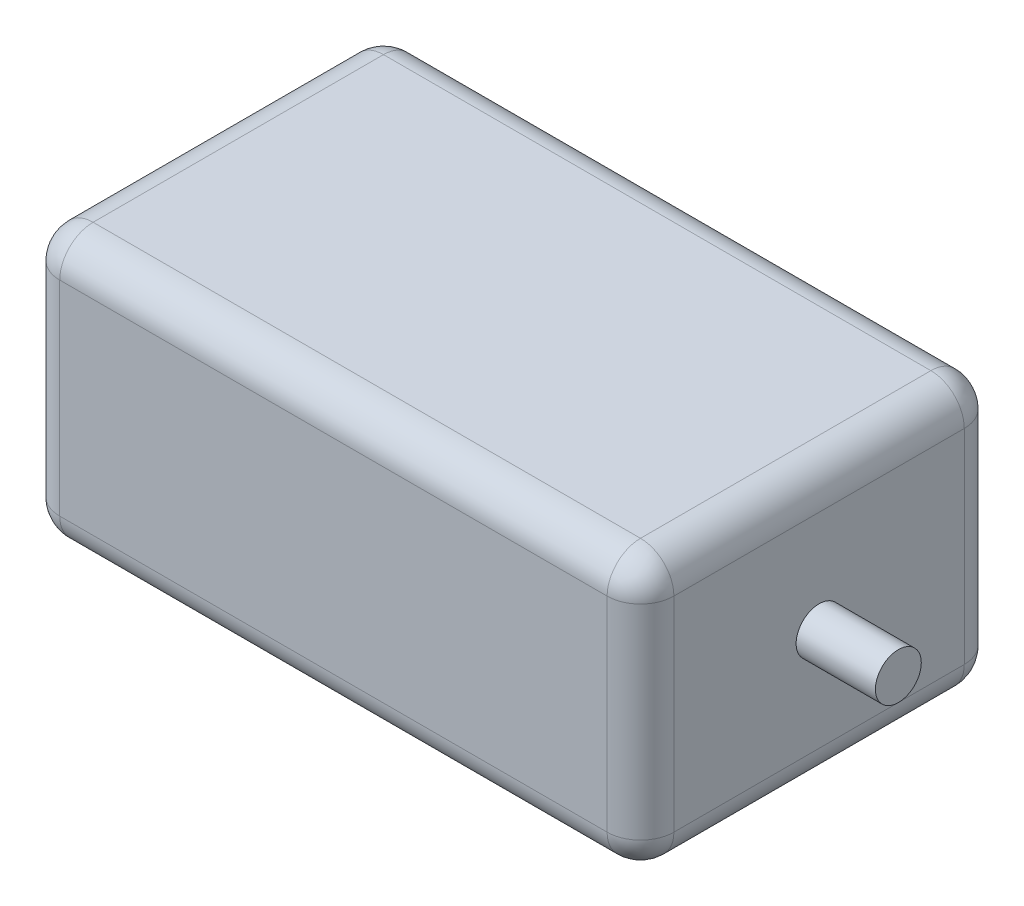
ISO-10303-21;
HEADER;
FILE_DESCRIPTION(('STEP AP214'),'2;1');
FILE_NAME('part.step','',(''),(''),'','','');
FILE_SCHEMA(('AUTOMOTIVE_DESIGN { 1 0 10303 214 1 1 1 1 }'));
ENDSEC;
DATA;
#1=APPLICATION_CONTEXT('core data for automotive mechanical design processes');
#2=APPLICATION_PROTOCOL_DEFINITION('international standard','automotive_design',2000,#1);
#3=PRODUCT_CONTEXT('',#1,'mechanical');
#4=PRODUCT('Part','Part','',(#3));
#5=PRODUCT_RELATED_PRODUCT_CATEGORY('part','',(#4));
#6=PRODUCT_DEFINITION_FORMATION('','',#4);
#7=PRODUCT_DEFINITION_CONTEXT('part definition',#1,'design');
#8=PRODUCT_DEFINITION('design','',#6,#7);
#9=PRODUCT_DEFINITION_SHAPE('','',#8);
#10=(LENGTH_UNIT() NAMED_UNIT(*) SI_UNIT(.MILLI.,.METRE.));
#11=(NAMED_UNIT(*) PLANE_ANGLE_UNIT() SI_UNIT($,.RADIAN.));
#12=(NAMED_UNIT(*) SI_UNIT($,.STERADIAN.) SOLID_ANGLE_UNIT());
#13=UNCERTAINTY_MEASURE_WITH_UNIT(LENGTH_MEASURE(1.E-05),#10,'distance_accuracy_value','');
#14=(GEOMETRIC_REPRESENTATION_CONTEXT(3) GLOBAL_UNCERTAINTY_ASSIGNED_CONTEXT((#13)) GLOBAL_UNIT_ASSIGNED_CONTEXT((#10,
#11,#12)) REPRESENTATION_CONTEXT('',''));
#15=CARTESIAN_POINT('',(0.,0.,0.));
#16=DIRECTION('',(0.,0.,1.));
#17=DIRECTION('',(1.,0.,0.));
#18=AXIS2_PLACEMENT_3D('',#15,#16,#17);
#19=CARTESIAN_POINT('',(40.0587135775645,32.5,-21.4));
#20=DIRECTION('',(-1.,0.,0.));
#21=DIRECTION('',(0.,0.,1.));
#22=AXIS2_PLACEMENT_3D('',#19,#20,#21);
#23=PLANE('',#22);
#24=DIRECTION('',(0.,0.,-1.));
#25=VECTOR('',#24,1.);
#26=CARTESIAN_POINT('',(40.0587135775645,28.5,21.4));
#27=LINE('',#26,#25);
#28=CARTESIAN_POINT('',(40.0587135775645,28.5,-17.4));
#29=VERTEX_POINT('',#28);
#30=CARTESIAN_POINT('',(40.0587135775645,28.5,17.4));
#31=VERTEX_POINT('',#30);
#32=EDGE_CURVE('E164',#29,#31,#27,.F.);
#33=ORIENTED_EDGE('',*,*,#32,.T.);
#34=DIRECTION('',(0.,-1.,0.));
#35=VECTOR('',#34,1.);
#36=CARTESIAN_POINT('',(40.0587135775645,32.5,17.4));
#37=LINE('',#36,#35);
#38=CARTESIAN_POINT('',(40.0587135775645,4.,17.4));
#39=VERTEX_POINT('',#38);
#40=EDGE_CURVE('E132',#31,#39,#37,.T.);
#41=ORIENTED_EDGE('',*,*,#40,.T.);
#42=DIRECTION('',(0.,0.,-1.));
#43=VECTOR('',#42,1.);
#44=CARTESIAN_POINT('',(40.0587135775645,4.,-21.4));
#45=LINE('',#44,#43);
#46=CARTESIAN_POINT('',(40.0587135775645,4.,-17.4));
#47=VERTEX_POINT('',#46);
#48=EDGE_CURVE('E152',#39,#47,#45,.T.);
#49=ORIENTED_EDGE('',*,*,#48,.T.);
#50=DIRECTION('',(0.,-1.,0.));
#51=VECTOR('',#50,1.);
#52=CARTESIAN_POINT('',(40.0587135775645,32.5,-17.4));
#53=LINE('',#52,#51);
#54=EDGE_CURVE('E159',#47,#29,#53,.F.);
#55=ORIENTED_EDGE('',*,*,#54,.T.);
#56=EDGE_LOOP('',(#33,#41,#49,#55));
#57=FACE_BOUND('',#56,.T.);
#58=CARTESIAN_POINT('',(40.0587135775645,16.25,0.));
#59=DIRECTION('',(-1.,0.,0.));
#60=DIRECTION('',(0.,0.,1.));
#61=AXIS2_PLACEMENT_3D('',#58,#59,#60);
#62=CIRCLE('',#61,2.75);
#63=CARTESIAN_POINT('',(40.0587135775645,16.25,2.75));
#64=VERTEX_POINT('',#63);
#65=EDGE_CURVE('E160',#64,#64,#62,.F.);
#66=ORIENTED_EDGE('',*,*,#65,.F.);
#67=EDGE_LOOP('',(#66));
#68=FACE_BOUND('',#67,.T.);
#69=ADVANCED_FACE('F38',(#57,#68),#23,.F.);
#70=CARTESIAN_POINT('',(-33.5412864224355,32.5,-21.4));
#71=DIRECTION('',(0.,0.,1.));
#72=DIRECTION('',(1.,0.,0.));
#73=AXIS2_PLACEMENT_3D('',#70,#71,#72);
#74=PLANE('',#73);
#75=DIRECTION('',(-1.,0.,0.));
#76=VECTOR('',#75,1.);
#77=CARTESIAN_POINT('',(40.0587135775645,28.5,-21.4));
#78=LINE('',#77,#76);
#79=CARTESIAN_POINT('',(-29.5412864224355,28.5,-21.4));
#80=VERTEX_POINT('',#79);
#81=CARTESIAN_POINT('',(36.0587135775645,28.5,-21.4));
#82=VERTEX_POINT('',#81);
#83=EDGE_CURVE('E202',#80,#82,#78,.F.);
#84=ORIENTED_EDGE('',*,*,#83,.T.);
#85=DIRECTION('',(0.,-1.,0.));
#86=VECTOR('',#85,1.);
#87=CARTESIAN_POINT('',(36.0587135775645,32.5,-21.4));
#88=LINE('',#87,#86);
#89=CARTESIAN_POINT('',(36.0587135775645,4.,-21.4));
#90=VERTEX_POINT('',#89);
#91=EDGE_CURVE('E205',#82,#90,#88,.T.);
#92=ORIENTED_EDGE('',*,*,#91,.T.);
#93=DIRECTION('',(-1.,0.,0.));
#94=VECTOR('',#93,1.);
#95=CARTESIAN_POINT('',(-33.5412864224355,4.,-21.4));
#96=LINE('',#95,#94);
#97=CARTESIAN_POINT('',(-29.5412864224355,4.,-21.4));
#98=VERTEX_POINT('',#97);
#99=EDGE_CURVE('E199',#90,#98,#96,.T.);
#100=ORIENTED_EDGE('',*,*,#99,.T.);
#101=DIRECTION('',(0.,-1.,0.));
#102=VECTOR('',#101,1.);
#103=CARTESIAN_POINT('',(-29.5412864224355,32.5,-21.4));
#104=LINE('',#103,#102);
#105=EDGE_CURVE('E196',#98,#80,#104,.F.);
#106=ORIENTED_EDGE('',*,*,#105,.T.);
#107=EDGE_LOOP('',(#84,#92,#100,#106));
#108=FACE_BOUND('',#107,.T.);
#109=ADVANCED_FACE('F374',(#108),#74,.F.);
#110=CARTESIAN_POINT('',(-33.5412864224355,32.5,-21.4));
#111=DIRECTION('',(1.,0.,0.));
#112=DIRECTION('',(0.,0.,-1.));
#113=AXIS2_PLACEMENT_3D('',#110,#111,#112);
#114=PLANE('',#113);
#115=DIRECTION('',(0.,0.,1.));
#116=VECTOR('',#115,1.);
#117=CARTESIAN_POINT('',(-33.5412864224355,4.,-21.4));
#118=LINE('',#117,#116);
#119=CARTESIAN_POINT('',(-33.5412864224355,4.,-17.4));
#120=VERTEX_POINT('',#119);
#121=CARTESIAN_POINT('',(-33.5412864224355,4.,17.4));
#122=VERTEX_POINT('',#121);
#123=EDGE_CURVE('E59',#120,#122,#118,.T.);
#124=ORIENTED_EDGE('',*,*,#123,.T.);
#125=DIRECTION('',(0.,-1.,0.));
#126=VECTOR('',#125,1.);
#127=CARTESIAN_POINT('',(-33.5412864224355,32.5,17.4));
#128=LINE('',#127,#126);
#129=CARTESIAN_POINT('',(-33.5412864224355,28.5,17.4));
#130=VERTEX_POINT('',#129);
#131=EDGE_CURVE('E11',#122,#130,#128,.F.);
#132=ORIENTED_EDGE('',*,*,#131,.T.);
#133=DIRECTION('',(0.,0.,1.));
#134=VECTOR('',#133,1.);
#135=CARTESIAN_POINT('',(-33.5412864224355,28.5,-21.4));
#136=LINE('',#135,#134);
#137=CARTESIAN_POINT('',(-33.5412864224355,28.5,-17.4));
#138=VERTEX_POINT('',#137);
#139=EDGE_CURVE('E48',#130,#138,#136,.F.);
#140=ORIENTED_EDGE('',*,*,#139,.T.);
#141=DIRECTION('',(0.,-1.,0.));
#142=VECTOR('',#141,1.);
#143=CARTESIAN_POINT('',(-33.5412864224355,32.5,-17.4));
#144=LINE('',#143,#142);
#145=EDGE_CURVE('E222',#138,#120,#144,.T.);
#146=ORIENTED_EDGE('',*,*,#145,.T.);
#147=EDGE_LOOP('',(#124,#132,#140,#146));
#148=FACE_BOUND('',#147,.T.);
#149=ADVANCED_FACE('F380',(#148),#114,.F.);
#150=CARTESIAN_POINT('',(-33.5412864224355,32.5,21.4));
#151=DIRECTION('',(0.,0.,-1.));
#152=DIRECTION('',(-1.,0.,0.));
#153=AXIS2_PLACEMENT_3D('',#150,#151,#152);
#154=PLANE('',#153);
#155=DIRECTION('',(1.,0.,0.));
#156=VECTOR('',#155,1.);
#157=CARTESIAN_POINT('',(-33.5412864224355,4.,21.4));
#158=LINE('',#157,#156);
#159=CARTESIAN_POINT('',(-29.5412864224355,4.,21.4));
#160=VERTEX_POINT('',#159);
#161=CARTESIAN_POINT('',(36.0587135775645,4.,21.4));
#162=VERTEX_POINT('',#161);
#163=EDGE_CURVE('E171',#160,#162,#158,.T.);
#164=ORIENTED_EDGE('',*,*,#163,.T.);
#165=DIRECTION('',(0.,-1.,0.));
#166=VECTOR('',#165,1.);
#167=CARTESIAN_POINT('',(36.0587135775645,32.5,21.4));
#168=LINE('',#167,#166);
#169=CARTESIAN_POINT('',(36.0587135775645,28.5,21.4));
#170=VERTEX_POINT('',#169);
#171=EDGE_CURVE('E134',#162,#170,#168,.F.);
#172=ORIENTED_EDGE('',*,*,#171,.T.);
#173=DIRECTION('',(1.,0.,0.));
#174=VECTOR('',#173,1.);
#175=CARTESIAN_POINT('',(-33.5412864224355,28.5,21.4));
#176=LINE('',#175,#174);
#177=CARTESIAN_POINT('',(-29.5412864224355,28.5,21.4));
#178=VERTEX_POINT('',#177);
#179=EDGE_CURVE('E178',#170,#178,#176,.F.);
#180=ORIENTED_EDGE('',*,*,#179,.T.);
#181=DIRECTION('',(0.,-1.,0.));
#182=VECTOR('',#181,1.);
#183=CARTESIAN_POINT('',(-29.5412864224355,32.5,21.4));
#184=LINE('',#183,#182);
#185=EDGE_CURVE('E167',#178,#160,#184,.T.);
#186=ORIENTED_EDGE('',*,*,#185,.T.);
#187=EDGE_LOOP('',(#164,#172,#180,#186));
#188=FACE_BOUND('',#187,.T.);
#189=ADVANCED_FACE('F346',(#188),#154,.F.);
#190=CARTESIAN_POINT('',(0.,32.5,0.));
#191=DIRECTION('',(0.,1.,0.));
#192=DIRECTION('',(0.,0.,1.));
#193=AXIS2_PLACEMENT_3D('',#190,#191,#192);
#194=PLANE('',#193);
#195=DIRECTION('',(1.,0.,0.));
#196=VECTOR('',#195,1.);
#197=CARTESIAN_POINT('',(40.0587135775645,32.5,17.4));
#198=LINE('',#197,#196);
#199=CARTESIAN_POINT('',(-29.5412864224355,32.5,17.4));
#200=VERTEX_POINT('',#199);
#201=CARTESIAN_POINT('',(36.0587135775645,32.5,17.4));
#202=VERTEX_POINT('',#201);
#203=EDGE_CURVE('E183',#200,#202,#198,.T.);
#204=ORIENTED_EDGE('',*,*,#203,.T.);
#205=DIRECTION('',(0.,0.,-1.));
#206=VECTOR('',#205,1.);
#207=CARTESIAN_POINT('',(36.0587135775645,32.5,-21.4));
#208=LINE('',#207,#206);
#209=CARTESIAN_POINT('',(36.0587135775645,32.5,-17.4));
#210=VERTEX_POINT('',#209);
#211=EDGE_CURVE('E192',#202,#210,#208,.T.);
#212=ORIENTED_EDGE('',*,*,#211,.T.);
#213=DIRECTION('',(-1.,0.,0.));
#214=VECTOR('',#213,1.);
#215=CARTESIAN_POINT('',(-33.5412864224355,32.5,-17.4));
#216=LINE('',#215,#214);
#217=CARTESIAN_POINT('',(-29.5412864224355,32.5,-17.4));
#218=VERTEX_POINT('',#217);
#219=EDGE_CURVE('E189',#210,#218,#216,.T.);
#220=ORIENTED_EDGE('',*,*,#219,.T.);
#221=DIRECTION('',(0.,0.,1.));
#222=VECTOR('',#221,1.);
#223=CARTESIAN_POINT('',(-29.5412864224355,32.5,21.4));
#224=LINE('',#223,#222);
#225=EDGE_CURVE('E186',#218,#200,#224,.T.);
#226=ORIENTED_EDGE('',*,*,#225,.T.);
#227=EDGE_LOOP('',(#204,#212,#220,#226));
#228=FACE_BOUND('',#227,.T.);
#229=ADVANCED_FACE('F557',(#228),#194,.T.);
#230=CARTESIAN_POINT('',(0.,0.,0.));
#231=DIRECTION('',(0.,1.,0.));
#232=DIRECTION('',(0.,0.,1.));
#233=AXIS2_PLACEMENT_3D('',#230,#231,#232);
#234=PLANE('',#233);
#235=DIRECTION('',(0.,0.,1.));
#236=VECTOR('',#235,1.);
#237=CARTESIAN_POINT('',(-29.5412864224355,0.,0.));
#238=LINE('',#237,#236);
#239=CARTESIAN_POINT('',(-29.5412864224355,0.,17.4));
#240=VERTEX_POINT('',#239);
#241=CARTESIAN_POINT('',(-29.5412864224355,0.,-17.4));
#242=VERTEX_POINT('',#241);
#243=EDGE_CURVE('E212',#240,#242,#238,.F.);
#244=ORIENTED_EDGE('',*,*,#243,.T.);
#245=DIRECTION('',(-1.,0.,0.));
#246=VECTOR('',#245,1.);
#247=CARTESIAN_POINT('',(0.,0.,-17.4));
#248=LINE('',#247,#246);
#249=CARTESIAN_POINT('',(36.0587135775645,0.,-17.4));
#250=VERTEX_POINT('',#249);
#251=EDGE_CURVE('E219',#242,#250,#248,.F.);
#252=ORIENTED_EDGE('',*,*,#251,.T.);
#253=DIRECTION('',(0.,0.,-1.));
#254=VECTOR('',#253,1.);
#255=CARTESIAN_POINT('',(36.0587135775645,0.,0.));
#256=LINE('',#255,#254);
#257=CARTESIAN_POINT('',(36.0587135775645,0.,17.4));
#258=VERTEX_POINT('',#257);
#259=EDGE_CURVE('E215',#250,#258,#256,.F.);
#260=ORIENTED_EDGE('',*,*,#259,.T.);
#261=DIRECTION('',(1.,0.,0.));
#262=VECTOR('',#261,1.);
#263=CARTESIAN_POINT('',(0.,0.,17.4));
#264=LINE('',#263,#262);
#265=EDGE_CURVE('E209',#258,#240,#264,.F.);
#266=ORIENTED_EDGE('',*,*,#265,.T.);
#267=EDGE_LOOP('',(#244,#252,#260,#266));
#268=FACE_BOUND('',#267,.T.);
#269=ADVANCED_FACE('F354',(#268),#234,.F.);
#270=CARTESIAN_POINT('',(49.5587135775645,16.25,0.));
#271=DIRECTION('',(-1.,0.,0.));
#272=DIRECTION('',(0.,0.,1.));
#273=AXIS2_PLACEMENT_3D('',#270,#271,#272);
#274=CYLINDRICAL_SURFACE('',#273,2.75);
#275=CARTESIAN_POINT('',(49.5587135775645,16.25,0.));
#276=DIRECTION('',(1.,0.,0.));
#277=DIRECTION('',(0.,0.,-1.));
#278=AXIS2_PLACEMENT_3D('',#275,#276,#277);
#279=CIRCLE('',#278,2.75);
#280=CARTESIAN_POINT('',(49.5587135775645,16.25,-2.75));
#281=VERTEX_POINT('',#280);
#282=EDGE_CURVE('E307',#281,#281,#279,.T.);
#283=ORIENTED_EDGE('',*,*,#282,.F.);
#284=EDGE_LOOP('',(#283));
#285=FACE_BOUND('',#284,.T.);
#286=ORIENTED_EDGE('',*,*,#65,.T.);
#287=EDGE_LOOP('',(#286));
#288=FACE_BOUND('',#287,.T.);
#289=ADVANCED_FACE('F542',(#285,#288),#274,.T.);
#290=CARTESIAN_POINT('',(49.5587135775645,16.25,0.));
#291=DIRECTION('',(1.,0.,0.));
#292=DIRECTION('',(0.,0.,-1.));
#293=AXIS2_PLACEMENT_3D('',#290,#291,#292);
#294=PLANE('',#293);
#295=ORIENTED_EDGE('',*,*,#282,.T.);
#296=EDGE_LOOP('',(#295));
#297=FACE_BOUND('',#296,.T.);
#298=ADVANCED_FACE('F534',(#297),#294,.T.);
#299=CARTESIAN_POINT('',(-29.5412864224355,32.5,-17.4));
#300=DIRECTION('',(0.,-1.,0.));
#301=DIRECTION('',(0.,0.,-1.));
#302=AXIS2_PLACEMENT_3D('',#299,#300,#301);
#303=CYLINDRICAL_SURFACE('',#302,4.);
#304=CARTESIAN_POINT('',(-29.5412864224355,28.5,-17.4));
#305=DIRECTION('',(0.,1.,0.));
#306=DIRECTION('',(0.,0.,1.));
#307=AXIS2_PLACEMENT_3D('',#304,#305,#306);
#308=CIRCLE('',#307,4.);
#309=EDGE_CURVE('E42',#80,#138,#308,.T.);
#310=ORIENTED_EDGE('',*,*,#309,.F.);
#311=ORIENTED_EDGE('',*,*,#105,.F.);
#312=CARTESIAN_POINT('',(-29.5412864224355,4.,-17.4));
#313=DIRECTION('',(0.,-1.,0.));
#314=DIRECTION('',(0.,0.,-1.));
#315=AXIS2_PLACEMENT_3D('',#312,#313,#314);
#316=CIRCLE('',#315,4.);
#317=EDGE_CURVE('E298',#120,#98,#316,.T.);
#318=ORIENTED_EDGE('',*,*,#317,.F.);
#319=ORIENTED_EDGE('',*,*,#145,.F.);
#320=EDGE_LOOP('',(#310,#311,#318,#319));
#321=FACE_BOUND('',#320,.T.);
#322=ADVANCED_FACE('F40',(#321),#303,.T.);
#323=CARTESIAN_POINT('',(-29.5412864224355,28.5,-17.4));
#324=DIRECTION('',(0.,0.,1.));
#325=DIRECTION('',(1.,0.,0.));
#326=AXIS2_PLACEMENT_3D('',#323,#324,#325);
#327=SPHERICAL_SURFACE('',#326,4.);
#328=CARTESIAN_POINT('',(-29.5412864224355,28.5,-17.4));
#329=DIRECTION('',(-1.,0.,0.));
#330=DIRECTION('',(0.,0.,1.));
#331=AXIS2_PLACEMENT_3D('',#328,#329,#330);
#332=CIRCLE('',#331,4.);
#333=EDGE_CURVE('E292',#80,#218,#332,.F.);
#334=ORIENTED_EDGE('',*,*,#333,.F.);
#335=ORIENTED_EDGE('',*,*,#309,.T.);
#336=CARTESIAN_POINT('',(-29.5412864224355,28.5,-17.4));
#337=DIRECTION('',(0.,0.,-1.));
#338=DIRECTION('',(-1.,0.,0.));
#339=AXIS2_PLACEMENT_3D('',#336,#337,#338);
#340=CIRCLE('',#339,4.);
#341=EDGE_CURVE('E296',#218,#138,#340,.F.);
#342=ORIENTED_EDGE('',*,*,#341,.F.);
#343=EDGE_LOOP('',(#334,#335,#342));
#344=FACE_BOUND('',#343,.T.);
#345=ADVANCED_FACE('F520',(#344),#327,.T.);
#346=CARTESIAN_POINT('',(-29.5412864224355,4.,-17.4));
#347=DIRECTION('',(0.,0.,1.));
#348=DIRECTION('',(1.,0.,0.));
#349=AXIS2_PLACEMENT_3D('',#346,#347,#348);
#350=SPHERICAL_SURFACE('',#349,4.);
#351=CARTESIAN_POINT('',(-29.5412864224355,4.,-17.4));
#352=DIRECTION('',(0.,0.,-1.));
#353=DIRECTION('',(-1.,0.,0.));
#354=AXIS2_PLACEMENT_3D('',#351,#352,#353);
#355=CIRCLE('',#354,4.);
#356=EDGE_CURVE('E284',#120,#242,#355,.F.);
#357=ORIENTED_EDGE('',*,*,#356,.F.);
#358=ORIENTED_EDGE('',*,*,#317,.T.);
#359=CARTESIAN_POINT('',(-29.5412864224355,4.,-17.4));
#360=DIRECTION('',(-1.,0.,0.));
#361=DIRECTION('',(0.,0.,1.));
#362=AXIS2_PLACEMENT_3D('',#359,#360,#361);
#363=CIRCLE('',#362,4.);
#364=EDGE_CURVE('E288',#242,#98,#363,.F.);
#365=ORIENTED_EDGE('',*,*,#364,.F.);
#366=EDGE_LOOP('',(#357,#358,#365));
#367=FACE_BOUND('',#366,.T.);
#368=ADVANCED_FACE('F511',(#367),#350,.T.);
#369=CARTESIAN_POINT('',(-29.5412864224355,28.5,0.));
#370=DIRECTION('',(0.,0.,-1.));
#371=DIRECTION('',(-1.,0.,0.));
#372=AXIS2_PLACEMENT_3D('',#369,#370,#371);
#373=CYLINDRICAL_SURFACE('',#372,4.);
#374=ORIENTED_EDGE('',*,*,#341,.T.);
#375=ORIENTED_EDGE('',*,*,#139,.F.);
#376=CARTESIAN_POINT('',(-29.5412864224355,28.5,17.4));
#377=DIRECTION('',(0.,0.,1.));
#378=DIRECTION('',(1.,0.,0.));
#379=AXIS2_PLACEMENT_3D('',#376,#377,#378);
#380=CIRCLE('',#379,4.);
#381=EDGE_CURVE('E276',#200,#130,#380,.T.);
#382=ORIENTED_EDGE('',*,*,#381,.F.);
#383=ORIENTED_EDGE('',*,*,#225,.F.);
#384=EDGE_LOOP('',(#374,#375,#382,#383));
#385=FACE_BOUND('',#384,.T.);
#386=ADVANCED_FACE('F502',(#385),#373,.T.);
#387=CARTESIAN_POINT('',(0.,28.5,-17.4));
#388=DIRECTION('',(1.,0.,0.));
#389=DIRECTION('',(0.,0.,-1.));
#390=AXIS2_PLACEMENT_3D('',#387,#388,#389);
#391=CYLINDRICAL_SURFACE('',#390,4.);
#392=ORIENTED_EDGE('',*,*,#333,.T.);
#393=ORIENTED_EDGE('',*,*,#219,.F.);
#394=CARTESIAN_POINT('',(36.0587135775645,28.5,-17.4));
#395=DIRECTION('',(1.,0.,0.));
#396=DIRECTION('',(0.,1.,0.));
#397=AXIS2_PLACEMENT_3D('',#394,#395,#396);
#398=CIRCLE('',#397,4.);
#399=EDGE_CURVE('E272',#82,#210,#398,.T.);
#400=ORIENTED_EDGE('',*,*,#399,.F.);
#401=ORIENTED_EDGE('',*,*,#83,.F.);
#402=EDGE_LOOP('',(#392,#393,#400,#401));
#403=FACE_BOUND('',#402,.T.);
#404=ADVANCED_FACE('F494',(#403),#391,.T.);
#405=CARTESIAN_POINT('',(36.0587135775645,32.5,-17.4));
#406=DIRECTION('',(0.,-1.,0.));
#407=DIRECTION('',(0.,0.,-1.));
#408=AXIS2_PLACEMENT_3D('',#405,#406,#407);
#409=CYLINDRICAL_SURFACE('',#408,4.);
#410=CARTESIAN_POINT('',(36.0587135775645,4.,-17.4));
#411=DIRECTION('',(0.,-1.,0.));
#412=DIRECTION('',(0.,0.,-1.));
#413=AXIS2_PLACEMENT_3D('',#410,#411,#412);
#414=CIRCLE('',#413,4.);
#415=EDGE_CURVE('E264',#90,#47,#414,.T.);
#416=ORIENTED_EDGE('',*,*,#415,.F.);
#417=ORIENTED_EDGE('',*,*,#91,.F.);
#418=CARTESIAN_POINT('',(36.0587135775645,28.5,-17.4));
#419=DIRECTION('',(0.,1.,0.));
#420=DIRECTION('',(0.,0.,1.));
#421=AXIS2_PLACEMENT_3D('',#418,#419,#420);
#422=CIRCLE('',#421,4.);
#423=EDGE_CURVE('E268',#29,#82,#422,.T.);
#424=ORIENTED_EDGE('',*,*,#423,.F.);
#425=ORIENTED_EDGE('',*,*,#54,.F.);
#426=EDGE_LOOP('',(#416,#417,#424,#425));
#427=FACE_BOUND('',#426,.T.);
#428=ADVANCED_FACE('F327',(#427),#409,.T.);
#429=CARTESIAN_POINT('',(-33.5412864224355,4.,-17.4));
#430=DIRECTION('',(-1.,0.,0.));
#431=DIRECTION('',(0.,0.,1.));
#432=AXIS2_PLACEMENT_3D('',#429,#430,#431);
#433=CYLINDRICAL_SURFACE('',#432,4.);
#434=ORIENTED_EDGE('',*,*,#364,.T.);
#435=ORIENTED_EDGE('',*,*,#99,.F.);
#436=CARTESIAN_POINT('',(36.0587135775645,4.,-17.4));
#437=DIRECTION('',(1.,0.,0.));
#438=DIRECTION('',(0.,0.,-1.));
#439=AXIS2_PLACEMENT_3D('',#436,#437,#438);
#440=CIRCLE('',#439,4.);
#441=EDGE_CURVE('E261',#250,#90,#440,.T.);
#442=ORIENTED_EDGE('',*,*,#441,.F.);
#443=ORIENTED_EDGE('',*,*,#251,.F.);
#444=EDGE_LOOP('',(#434,#435,#442,#443));
#445=FACE_BOUND('',#444,.T.);
#446=ADVANCED_FACE('F359',(#445),#433,.T.);
#447=CARTESIAN_POINT('',(-29.5412864224355,4.,-21.4));
#448=DIRECTION('',(0.,0.,1.));
#449=DIRECTION('',(1.,0.,0.));
#450=AXIS2_PLACEMENT_3D('',#447,#448,#449);
#451=CYLINDRICAL_SURFACE('',#450,4.);
#452=ORIENTED_EDGE('',*,*,#356,.T.);
#453=ORIENTED_EDGE('',*,*,#243,.F.);
#454=CARTESIAN_POINT('',(-29.5412864224355,4.,17.4));
#455=DIRECTION('',(0.,0.,1.));
#456=DIRECTION('',(1.,0.,0.));
#457=AXIS2_PLACEMENT_3D('',#454,#455,#456);
#458=CIRCLE('',#457,4.);
#459=EDGE_CURVE('E257',#122,#240,#458,.T.);
#460=ORIENTED_EDGE('',*,*,#459,.F.);
#461=ORIENTED_EDGE('',*,*,#123,.F.);
#462=EDGE_LOOP('',(#452,#453,#460,#461));
#463=FACE_BOUND('',#462,.T.);
#464=ADVANCED_FACE('F470',(#463),#451,.T.);
#465=CARTESIAN_POINT('',(-29.5412864224355,32.5,17.4));
#466=DIRECTION('',(0.,-1.,0.));
#467=DIRECTION('',(0.,0.,-1.));
#468=AXIS2_PLACEMENT_3D('',#465,#466,#467);
#469=CYLINDRICAL_SURFACE('',#468,4.);
#470=CARTESIAN_POINT('',(-29.5412864224355,28.5,17.4));
#471=DIRECTION('',(0.,1.,0.));
#472=DIRECTION('',(0.,0.,1.));
#473=AXIS2_PLACEMENT_3D('',#470,#471,#472);
#474=CIRCLE('',#473,4.);
#475=EDGE_CURVE('E280',#130,#178,#474,.T.);
#476=ORIENTED_EDGE('',*,*,#475,.F.);
#477=ORIENTED_EDGE('',*,*,#131,.F.);
#478=CARTESIAN_POINT('',(-29.5412864224355,4.,17.4));
#479=DIRECTION('',(0.,-1.,0.));
#480=DIRECTION('',(0.,0.,-1.));
#481=AXIS2_PLACEMENT_3D('',#478,#479,#480);
#482=CIRCLE('',#481,4.);
#483=EDGE_CURVE('E253',#160,#122,#482,.T.);
#484=ORIENTED_EDGE('',*,*,#483,.F.);
#485=ORIENTED_EDGE('',*,*,#185,.F.);
#486=EDGE_LOOP('',(#476,#477,#484,#485));
#487=FACE_BOUND('',#486,.T.);
#488=ADVANCED_FACE('F461',(#487),#469,.T.);
#489=CARTESIAN_POINT('',(-29.5412864224355,28.5,17.4));
#490=DIRECTION('',(0.,0.,1.));
#491=DIRECTION('',(1.,0.,0.));
#492=AXIS2_PLACEMENT_3D('',#489,#490,#491);
#493=SPHERICAL_SURFACE('',#492,4.);
#494=ORIENTED_EDGE('',*,*,#381,.T.);
#495=ORIENTED_EDGE('',*,*,#475,.T.);
#496=CARTESIAN_POINT('',(-29.5412864224355,28.5,17.4));
#497=DIRECTION('',(-1.,0.,0.));
#498=DIRECTION('',(0.,0.,1.));
#499=AXIS2_PLACEMENT_3D('',#496,#497,#498);
#500=CIRCLE('',#499,4.);
#501=EDGE_CURVE('E249',#200,#178,#500,.F.);
#502=ORIENTED_EDGE('',*,*,#501,.F.);
#503=EDGE_LOOP('',(#494,#495,#502));
#504=FACE_BOUND('',#503,.T.);
#505=ADVANCED_FACE('F371',(#504),#493,.T.);
#506=CARTESIAN_POINT('',(36.0587135775645,28.5,-17.4));
#507=DIRECTION('',(0.,0.,1.));
#508=DIRECTION('',(1.,0.,0.));
#509=AXIS2_PLACEMENT_3D('',#506,#507,#508);
#510=SPHERICAL_SURFACE('',#509,4.);
#511=ORIENTED_EDGE('',*,*,#423,.T.);
#512=ORIENTED_EDGE('',*,*,#399,.T.);
#513=CARTESIAN_POINT('',(36.0587135775645,28.5,-17.4));
#514=DIRECTION('',(0.,0.,-1.));
#515=DIRECTION('',(-1.,0.,0.));
#516=AXIS2_PLACEMENT_3D('',#513,#514,#515);
#517=CIRCLE('',#516,4.);
#518=EDGE_CURVE('E246',#29,#210,#517,.F.);
#519=ORIENTED_EDGE('',*,*,#518,.F.);
#520=EDGE_LOOP('',(#511,#512,#519));
#521=FACE_BOUND('',#520,.T.);
#522=ADVANCED_FACE('F330',(#521),#510,.T.);
#523=CARTESIAN_POINT('',(36.0587135775645,4.,-17.4));
#524=DIRECTION('',(0.,0.,1.));
#525=DIRECTION('',(1.,0.,0.));
#526=AXIS2_PLACEMENT_3D('',#523,#524,#525);
#527=SPHERICAL_SURFACE('',#526,4.);
#528=ORIENTED_EDGE('',*,*,#441,.T.);
#529=ORIENTED_EDGE('',*,*,#415,.T.);
#530=CARTESIAN_POINT('',(36.0587135775645,4.,-17.4));
#531=DIRECTION('',(0.,0.,-1.));
#532=DIRECTION('',(-1.,0.,0.));
#533=AXIS2_PLACEMENT_3D('',#530,#531,#532);
#534=CIRCLE('',#533,4.);
#535=EDGE_CURVE('E155',#250,#47,#534,.F.);
#536=ORIENTED_EDGE('',*,*,#535,.F.);
#537=EDGE_LOOP('',(#528,#529,#536));
#538=FACE_BOUND('',#537,.T.);
#539=ADVANCED_FACE('F361',(#538),#527,.T.);
#540=CARTESIAN_POINT('',(-29.5412864224355,4.,17.4));
#541=DIRECTION('',(0.,0.,1.));
#542=DIRECTION('',(1.,0.,0.));
#543=AXIS2_PLACEMENT_3D('',#540,#541,#542);
#544=SPHERICAL_SURFACE('',#543,4.);
#545=ORIENTED_EDGE('',*,*,#483,.T.);
#546=ORIENTED_EDGE('',*,*,#459,.T.);
#547=CARTESIAN_POINT('',(-29.5412864224355,4.,17.4));
#548=DIRECTION('',(-1.,0.,0.));
#549=DIRECTION('',(0.,0.,1.));
#550=AXIS2_PLACEMENT_3D('',#547,#548,#549);
#551=CIRCLE('',#550,4.);
#552=EDGE_CURVE('E240',#160,#240,#551,.F.);
#553=ORIENTED_EDGE('',*,*,#552,.F.);
#554=EDGE_LOOP('',(#545,#546,#553));
#555=FACE_BOUND('',#554,.T.);
#556=ADVANCED_FACE('F363',(#555),#544,.T.);
#557=CARTESIAN_POINT('',(0.,28.5,17.4));
#558=DIRECTION('',(-1.,0.,0.));
#559=DIRECTION('',(0.,0.,1.));
#560=AXIS2_PLACEMENT_3D('',#557,#558,#559);
#561=CYLINDRICAL_SURFACE('',#560,4.);
#562=ORIENTED_EDGE('',*,*,#501,.T.);
#563=ORIENTED_EDGE('',*,*,#179,.F.);
#564=CARTESIAN_POINT('',(36.0587135775645,28.5,17.4));
#565=DIRECTION('',(1.,0.,0.));
#566=DIRECTION('',(0.,0.,-1.));
#567=AXIS2_PLACEMENT_3D('',#564,#565,#566);
#568=CIRCLE('',#567,4.);
#569=EDGE_CURVE('E236',#202,#170,#568,.T.);
#570=ORIENTED_EDGE('',*,*,#569,.F.);
#571=ORIENTED_EDGE('',*,*,#203,.F.);
#572=EDGE_LOOP('',(#562,#563,#570,#571));
#573=FACE_BOUND('',#572,.T.);
#574=ADVANCED_FACE('F342',(#573),#561,.T.);
#575=CARTESIAN_POINT('',(36.0587135775645,28.5,0.));
#576=DIRECTION('',(0.,0.,1.));
#577=DIRECTION('',(1.,0.,0.));
#578=AXIS2_PLACEMENT_3D('',#575,#576,#577);
#579=CYLINDRICAL_SURFACE('',#578,4.);
#580=ORIENTED_EDGE('',*,*,#518,.T.);
#581=ORIENTED_EDGE('',*,*,#211,.F.);
#582=CARTESIAN_POINT('',(36.0587135775645,28.5,17.4));
#583=DIRECTION('',(0.,0.,1.));
#584=DIRECTION('',(0.,-1.,0.));
#585=AXIS2_PLACEMENT_3D('',#582,#583,#584);
#586=CIRCLE('',#585,4.);
#587=EDGE_CURVE('E149',#31,#202,#586,.T.);
#588=ORIENTED_EDGE('',*,*,#587,.F.);
#589=ORIENTED_EDGE('',*,*,#32,.F.);
#590=EDGE_LOOP('',(#580,#581,#588,#589));
#591=FACE_BOUND('',#590,.T.);
#592=ADVANCED_FACE('F334',(#591),#579,.T.);
#593=CARTESIAN_POINT('',(36.0587135775645,4.,-21.4));
#594=DIRECTION('',(0.,0.,-1.));
#595=DIRECTION('',(-1.,0.,0.));
#596=AXIS2_PLACEMENT_3D('',#593,#594,#595);
#597=CYLINDRICAL_SURFACE('',#596,4.);
#598=ORIENTED_EDGE('',*,*,#535,.T.);
#599=ORIENTED_EDGE('',*,*,#48,.F.);
#600=CARTESIAN_POINT('',(36.0587135775645,4.,17.4));
#601=DIRECTION('',(0.,0.,1.));
#602=DIRECTION('',(1.,0.,0.));
#603=AXIS2_PLACEMENT_3D('',#600,#601,#602);
#604=CIRCLE('',#603,4.);
#605=EDGE_CURVE('E140',#258,#39,#604,.T.);
#606=ORIENTED_EDGE('',*,*,#605,.F.);
#607=ORIENTED_EDGE('',*,*,#259,.F.);
#608=EDGE_LOOP('',(#598,#599,#606,#607));
#609=FACE_BOUND('',#608,.T.);
#610=ADVANCED_FACE('F153',(#609),#597,.T.);
#611=CARTESIAN_POINT('',(-33.5412864224355,4.,17.4));
#612=DIRECTION('',(1.,0.,0.));
#613=DIRECTION('',(0.,0.,-1.));
#614=AXIS2_PLACEMENT_3D('',#611,#612,#613);
#615=CYLINDRICAL_SURFACE('',#614,4.);
#616=ORIENTED_EDGE('',*,*,#552,.T.);
#617=ORIENTED_EDGE('',*,*,#265,.F.);
#618=CARTESIAN_POINT('',(36.0587135775645,4.,17.4));
#619=DIRECTION('',(1.,0.,0.));
#620=DIRECTION('',(0.,0.,-1.));
#621=AXIS2_PLACEMENT_3D('',#618,#619,#620);
#622=CIRCLE('',#621,4.);
#623=EDGE_CURVE('E144',#162,#258,#622,.T.);
#624=ORIENTED_EDGE('',*,*,#623,.F.);
#625=ORIENTED_EDGE('',*,*,#163,.F.);
#626=EDGE_LOOP('',(#616,#617,#624,#625));
#627=FACE_BOUND('',#626,.T.);
#628=ADVANCED_FACE('F350',(#627),#615,.T.);
#629=CARTESIAN_POINT('',(36.0587135775645,28.5,17.4));
#630=DIRECTION('',(0.,0.,1.));
#631=DIRECTION('',(1.,0.,0.));
#632=AXIS2_PLACEMENT_3D('',#629,#630,#631);
#633=SPHERICAL_SURFACE('',#632,4.);
#634=ORIENTED_EDGE('',*,*,#587,.T.);
#635=ORIENTED_EDGE('',*,*,#569,.T.);
#636=CARTESIAN_POINT('',(36.0587135775645,28.5,17.4));
#637=DIRECTION('',(0.,1.,0.));
#638=DIRECTION('',(0.,0.,1.));
#639=AXIS2_PLACEMENT_3D('',#636,#637,#638);
#640=CIRCLE('',#639,4.);
#641=EDGE_CURVE('E137',#31,#170,#640,.F.);
#642=ORIENTED_EDGE('',*,*,#641,.F.);
#643=EDGE_LOOP('',(#634,#635,#642));
#644=FACE_BOUND('',#643,.T.);
#645=ADVANCED_FACE('F338',(#644),#633,.T.);
#646=CARTESIAN_POINT('',(36.0587135775645,4.,17.4));
#647=DIRECTION('',(0.,0.,1.));
#648=DIRECTION('',(1.,0.,0.));
#649=AXIS2_PLACEMENT_3D('',#646,#647,#648);
#650=SPHERICAL_SURFACE('',#649,4.);
#651=ORIENTED_EDGE('',*,*,#623,.T.);
#652=ORIENTED_EDGE('',*,*,#605,.T.);
#653=CARTESIAN_POINT('',(36.0587135775645,4.,17.4));
#654=DIRECTION('',(0.,-1.,0.));
#655=DIRECTION('',(0.,0.,-1.));
#656=AXIS2_PLACEMENT_3D('',#653,#654,#655);
#657=CIRCLE('',#656,4.);
#658=EDGE_CURVE('E128',#162,#39,#657,.F.);
#659=ORIENTED_EDGE('',*,*,#658,.F.);
#660=EDGE_LOOP('',(#651,#652,#659));
#661=FACE_BOUND('',#660,.T.);
#662=ADVANCED_FACE('F142',(#661),#650,.T.);
#663=CARTESIAN_POINT('',(36.0587135775645,32.5,17.4));
#664=DIRECTION('',(0.,-1.,0.));
#665=DIRECTION('',(0.,0.,-1.));
#666=AXIS2_PLACEMENT_3D('',#663,#664,#665);
#667=CYLINDRICAL_SURFACE('',#666,4.);
#668=ORIENTED_EDGE('',*,*,#641,.T.);
#669=ORIENTED_EDGE('',*,*,#171,.F.);
#670=ORIENTED_EDGE('',*,*,#658,.T.);
#671=ORIENTED_EDGE('',*,*,#40,.F.);
#672=EDGE_LOOP('',(#668,#669,#670,#671));
#673=FACE_BOUND('',#672,.T.);
#674=ADVANCED_FACE('F130',(#673),#667,.T.);
#675=CLOSED_SHELL('',(#69,#109,#149,#189,#229,#269,#289,#298,#322,#345,#368,#386,#404,#428,#446,
#464,#488,#505,#522,#539,#556,#574,#592,#610,#628,#645,#662,#674));
#676=MANIFOLD_SOLID_BREP('B2',#675);
#677=ADVANCED_BREP_SHAPE_REPRESENTATION('',(#18,#676),#14);
#678=SHAPE_DEFINITION_REPRESENTATION(#9,#677);
ENDSEC;
END-ISO-10303-21;
